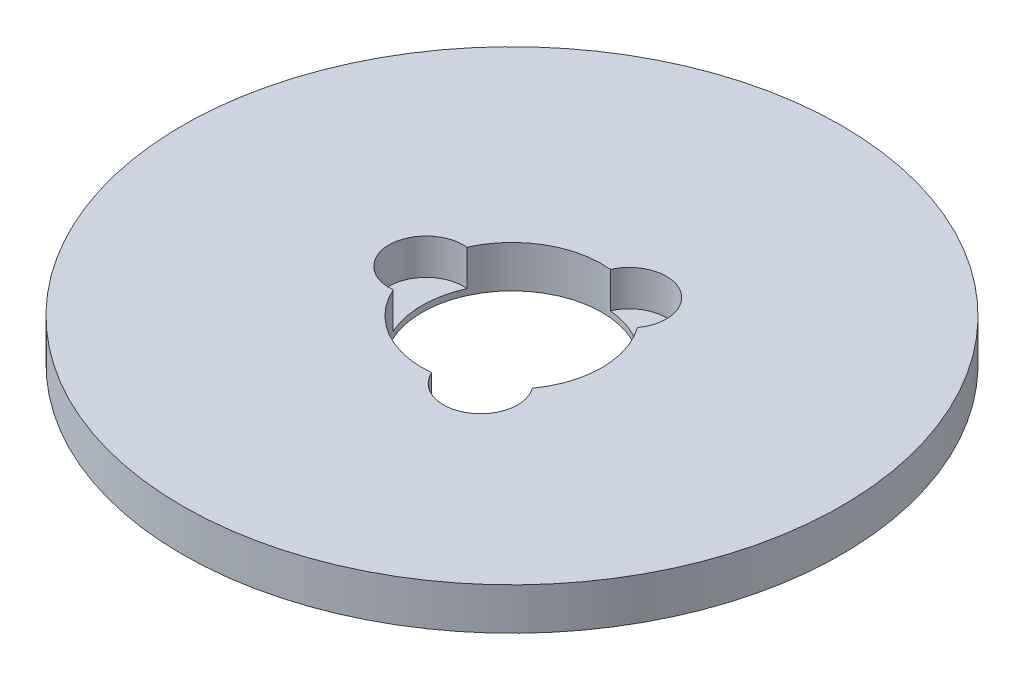
ISO-10303-21;
HEADER;
FILE_DESCRIPTION(('STEP AP214'),'2;1');
FILE_NAME('part.step','',(''),(''),'','','');
FILE_SCHEMA(('AUTOMOTIVE_DESIGN { 1 0 10303 214 1 1 1 1 }'));
ENDSEC;
DATA;
#1=APPLICATION_CONTEXT('core data for automotive mechanical design processes');
#2=APPLICATION_PROTOCOL_DEFINITION('international standard','automotive_design',2000,#1);
#3=PRODUCT_CONTEXT('',#1,'mechanical');
#4=PRODUCT('Part','Part','',(#3));
#5=PRODUCT_RELATED_PRODUCT_CATEGORY('part','',(#4));
#6=PRODUCT_DEFINITION_FORMATION('','',#4);
#7=PRODUCT_DEFINITION_CONTEXT('part definition',#1,'design');
#8=PRODUCT_DEFINITION('design','',#6,#7);
#9=PRODUCT_DEFINITION_SHAPE('','',#8);
#10=(LENGTH_UNIT() NAMED_UNIT(*) SI_UNIT(.MILLI.,.METRE.));
#11=(NAMED_UNIT(*) PLANE_ANGLE_UNIT() SI_UNIT($,.RADIAN.));
#12=(NAMED_UNIT(*) SI_UNIT($,.STERADIAN.) SOLID_ANGLE_UNIT());
#13=UNCERTAINTY_MEASURE_WITH_UNIT(LENGTH_MEASURE(1.E-05),#10,'distance_accuracy_value','');
#14=(GEOMETRIC_REPRESENTATION_CONTEXT(3) GLOBAL_UNCERTAINTY_ASSIGNED_CONTEXT((#13)) GLOBAL_UNIT_ASSIGNED_CONTEXT((#10,
#11,#12)) REPRESENTATION_CONTEXT('',''));
#15=CARTESIAN_POINT('',(0.,0.,0.));
#16=DIRECTION('',(0.,0.,1.));
#17=DIRECTION('',(1.,0.,0.));
#18=AXIS2_PLACEMENT_3D('',#15,#16,#17);
#19=CARTESIAN_POINT('',(0.,7.,0.));
#20=DIRECTION('',(0.,-1.,0.));
#21=DIRECTION('',(0.,0.,-1.));
#22=AXIS2_PLACEMENT_3D('',#19,#20,#21);
#23=CYLINDRICAL_SURFACE('',#22,55.);
#24=CARTESIAN_POINT('',(0.,7.,0.));
#25=DIRECTION('',(0.,1.,0.));
#26=DIRECTION('',(0.,0.,1.));
#27=AXIS2_PLACEMENT_3D('',#24,#25,#26);
#28=CIRCLE('',#27,55.);
#29=CARTESIAN_POINT('',(0.,7.,55.));
#30=VERTEX_POINT('',#29);
#31=EDGE_CURVE('E126',#30,#30,#28,.T.);
#32=ORIENTED_EDGE('',*,*,#31,.F.);
#33=EDGE_LOOP('',(#32));
#34=FACE_BOUND('',#33,.T.);
#35=CARTESIAN_POINT('',(0.,0.,0.));
#36=DIRECTION('',(0.,1.,0.));
#37=DIRECTION('',(0.,0.,1.));
#38=AXIS2_PLACEMENT_3D('',#35,#36,#37);
#39=CIRCLE('',#38,55.);
#40=CARTESIAN_POINT('',(0.,0.,55.));
#41=VERTEX_POINT('',#40);
#42=EDGE_CURVE('E124',#41,#41,#39,.T.);
#43=ORIENTED_EDGE('',*,*,#42,.T.);
#44=EDGE_LOOP('',(#43));
#45=FACE_BOUND('',#44,.T.);
#46=ADVANCED_FACE('F39',(#34,#45),#23,.T.);
#47=CARTESIAN_POINT('',(0.,7.,0.));
#48=DIRECTION('',(0.,1.,0.));
#49=DIRECTION('',(0.,0.,1.));
#50=AXIS2_PLACEMENT_3D('',#47,#48,#49);
#51=PLANE('',#50);
#52=CARTESIAN_POINT('',(7.16588052473661,7.,12.411669149812));
#53=DIRECTION('',(0.,1.,0.));
#54=DIRECTION('',(0.866025403784436,0.,-0.500000000000004));
#55=AXIS2_PLACEMENT_3D('',#52,#53,#54);
#56=CIRCLE('',#55,6.18322846456152);
#57=CARTESIAN_POINT('',(1.51571185711763,7.,14.9232241009171));
#58=VERTEX_POINT('',#57);
#59=CARTESIAN_POINT('',(12.1660352492037,7.,8.77425702353959));
#60=VERTEX_POINT('',#59);
#61=EDGE_CURVE('E147',#58,#60,#56,.T.);
#62=ORIENTED_EDGE('',*,*,#61,.F.);
#63=CARTESIAN_POINT('',(0.,7.,0.));
#64=DIRECTION('',(0.,1.,0.));
#65=DIRECTION('',(0.,0.,1.));
#66=AXIS2_PLACEMENT_3D('',#63,#64,#65);
#67=CIRCLE('',#66,15.);
#68=CARTESIAN_POINT('',(-13.6817471063212,7.,6.14896707737746));
#69=VERTEX_POINT('',#68);
#70=EDGE_CURVE('E118',#69,#58,#67,.T.);
#71=ORIENTED_EDGE('',*,*,#70,.F.);
#72=CARTESIAN_POINT('',(-14.3317610494731,7.,0.));
#73=DIRECTION('',(0.,1.,0.));
#74=DIRECTION('',(0.,0.,1.));
#75=AXIS2_PLACEMENT_3D('',#72,#73,#74);
#76=CIRCLE('',#75,6.18322846456152);
#77=CARTESIAN_POINT('',(-13.6817471063212,7.,-6.14896707737746));
#78=VERTEX_POINT('',#77);
#79=EDGE_CURVE('E113',#78,#69,#76,.T.);
#80=ORIENTED_EDGE('',*,*,#79,.F.);
#81=CARTESIAN_POINT('',(1.51571185711742,7.,-14.9232241009171));
#82=VERTEX_POINT('',#81);
#83=EDGE_CURVE('E106',#82,#78,#67,.T.);
#84=ORIENTED_EDGE('',*,*,#83,.F.);
#85=CARTESIAN_POINT('',(7.16588052473644,7.,-12.4116691498121));
#86=DIRECTION('',(0.,1.,0.));
#87=DIRECTION('',(-0.866025403784443,0.,-0.499999999999992));
#88=AXIS2_PLACEMENT_3D('',#85,#86,#87);
#89=CIRCLE('',#88,6.18322846456152);
#90=CARTESIAN_POINT('',(12.1660352492035,7.,-8.77425702353976));
#91=VERTEX_POINT('',#90);
#92=EDGE_CURVE('E90',#91,#82,#89,.T.);
#93=ORIENTED_EDGE('',*,*,#92,.F.);
#94=EDGE_CURVE('E116',#60,#91,#67,.T.);
#95=ORIENTED_EDGE('',*,*,#94,.F.);
#96=EDGE_LOOP('',(#62,#71,#80,#84,#93,#95));
#97=FACE_BOUND('',#96,.T.);
#98=ORIENTED_EDGE('',*,*,#31,.T.);
#99=EDGE_LOOP('',(#98));
#100=FACE_BOUND('',#99,.T.);
#101=ADVANCED_FACE('F115',(#97,#100),#51,.T.);
#102=CARTESIAN_POINT('',(0.,0.,0.));
#103=DIRECTION('',(0.,1.,0.));
#104=DIRECTION('',(0.,0.,1.));
#105=AXIS2_PLACEMENT_3D('',#102,#103,#104);
#106=PLANE('',#105);
#107=CARTESIAN_POINT('',(0.,0.,0.));
#108=DIRECTION('',(0.,1.,0.));
#109=DIRECTION('',(0.,0.,1.));
#110=AXIS2_PLACEMENT_3D('',#107,#108,#109);
#111=CIRCLE('',#110,15.);
#112=CARTESIAN_POINT('',(0.,0.,15.));
#113=VERTEX_POINT('',#112);
#114=EDGE_CURVE('E120',#113,#113,#111,.T.);
#115=ORIENTED_EDGE('',*,*,#114,.T.);
#116=EDGE_LOOP('',(#115));
#117=FACE_BOUND('',#116,.T.);
#118=ORIENTED_EDGE('',*,*,#42,.F.);
#119=EDGE_LOOP('',(#118));
#120=FACE_BOUND('',#119,.T.);
#121=ADVANCED_FACE('F164',(#117,#120),#106,.F.);
#122=CARTESIAN_POINT('',(0.,7.,0.));
#123=DIRECTION('',(0.,-1.,0.));
#124=DIRECTION('',(0.,0.,-1.));
#125=AXIS2_PLACEMENT_3D('',#122,#123,#124);
#126=CYLINDRICAL_SURFACE('',#125,15.);
#127=DIRECTION('',(0.,1.,0.));
#128=VECTOR('',#127,1.);
#129=CARTESIAN_POINT('',(1.51571185711763,4.0082175307494,14.9232241009171));
#130=LINE('',#129,#128);
#131=CARTESIAN_POINT('',(1.51571185711763,1.01643506149879,14.9232241009171));
#132=VERTEX_POINT('',#131);
#133=EDGE_CURVE('E11',#132,#58,#130,.T.);
#134=ORIENTED_EDGE('',*,*,#133,.F.);
#135=CARTESIAN_POINT('',(0.,1.01643506149879,0.));
#136=DIRECTION('',(0.,1.,0.));
#137=DIRECTION('',(0.,0.,1.));
#138=AXIS2_PLACEMENT_3D('',#135,#136,#137);
#139=CIRCLE('',#138,15.);
#140=CARTESIAN_POINT('',(12.1660352492037,1.01643506149879,8.77425702353959));
#141=VERTEX_POINT('',#140);
#142=EDGE_CURVE('E144',#132,#141,#139,.T.);
#143=ORIENTED_EDGE('',*,*,#142,.T.);
#144=DIRECTION('',(0.,1.,0.));
#145=VECTOR('',#144,1.);
#146=CARTESIAN_POINT('',(12.1660352492037,4.0082175307494,8.77425702353959));
#147=LINE('',#146,#145);
#148=EDGE_CURVE('E46',#60,#141,#147,.F.);
#149=ORIENTED_EDGE('',*,*,#148,.F.);
#150=ORIENTED_EDGE('',*,*,#94,.T.);
#151=DIRECTION('',(0.,1.,0.));
#152=VECTOR('',#151,1.);
#153=CARTESIAN_POINT('',(12.1660352492035,4.0082175307494,-8.77425702353976));
#154=LINE('',#153,#152);
#155=CARTESIAN_POINT('',(12.1660352492035,1.01643506149879,-8.77425702353976));
#156=VERTEX_POINT('',#155);
#157=EDGE_CURVE('E92',#156,#91,#154,.T.);
#158=ORIENTED_EDGE('',*,*,#157,.F.);
#159=CARTESIAN_POINT('',(0.,1.01643506149879,0.));
#160=DIRECTION('',(0.,1.,0.));
#161=DIRECTION('',(0.,0.,1.));
#162=AXIS2_PLACEMENT_3D('',#159,#160,#161);
#163=CIRCLE('',#162,15.);
#164=CARTESIAN_POINT('',(1.51571185711742,1.01643506149879,-14.9232241009171));
#165=VERTEX_POINT('',#164);
#166=EDGE_CURVE('E107',#156,#165,#163,.T.);
#167=ORIENTED_EDGE('',*,*,#166,.T.);
#168=DIRECTION('',(0.,1.,0.));
#169=VECTOR('',#168,1.);
#170=CARTESIAN_POINT('',(1.51571185711742,4.0082175307494,-14.9232241009171));
#171=LINE('',#170,#169);
#172=EDGE_CURVE('E95',#82,#165,#171,.F.);
#173=ORIENTED_EDGE('',*,*,#172,.F.);
#174=ORIENTED_EDGE('',*,*,#83,.T.);
#175=DIRECTION('',(0.,1.,0.));
#176=VECTOR('',#175,1.);
#177=CARTESIAN_POINT('',(-13.6817471063212,4.0082175307494,-6.14896707737746));
#178=LINE('',#177,#176);
#179=CARTESIAN_POINT('',(-13.6817471063212,1.01643506149879,-6.14896707737746));
#180=VERTEX_POINT('',#179);
#181=EDGE_CURVE('E143',#180,#78,#178,.T.);
#182=ORIENTED_EDGE('',*,*,#181,.F.);
#183=CARTESIAN_POINT('',(0.,1.01643506149879,0.));
#184=DIRECTION('',(0.,1.,0.));
#185=DIRECTION('',(0.,0.,1.));
#186=AXIS2_PLACEMENT_3D('',#183,#184,#185);
#187=CIRCLE('',#186,15.);
#188=CARTESIAN_POINT('',(-13.6817471063212,1.01643506149879,6.14896707737746));
#189=VERTEX_POINT('',#188);
#190=EDGE_CURVE('E132',#180,#189,#187,.T.);
#191=ORIENTED_EDGE('',*,*,#190,.T.);
#192=DIRECTION('',(0.,1.,0.));
#193=VECTOR('',#192,1.);
#194=CARTESIAN_POINT('',(-13.6817471063212,4.0082175307494,6.14896707737746));
#195=LINE('',#194,#193);
#196=EDGE_CURVE('E137',#69,#189,#195,.F.);
#197=ORIENTED_EDGE('',*,*,#196,.F.);
#198=ORIENTED_EDGE('',*,*,#70,.T.);
#199=EDGE_LOOP('',(#134,#143,#149,#150,#158,#167,#173,#174,#182,#191,#197,#198));
#200=FACE_BOUND('',#199,.T.);
#201=ORIENTED_EDGE('',*,*,#114,.F.);
#202=EDGE_LOOP('',(#201));
#203=FACE_BOUND('',#202,.T.);
#204=ADVANCED_FACE('F103',(#200,#203),#126,.F.);
#205=CARTESIAN_POINT('',(-14.3317610494731,1.01643506149879,0.));
#206=DIRECTION('',(0.,1.,0.));
#207=DIRECTION('',(0.,0.,1.));
#208=AXIS2_PLACEMENT_3D('',#205,#206,#207);
#209=CYLINDRICAL_SURFACE('',#208,6.18322846456152);
#210=ORIENTED_EDGE('',*,*,#181,.T.);
#211=ORIENTED_EDGE('',*,*,#79,.T.);
#212=ORIENTED_EDGE('',*,*,#196,.T.);
#213=CARTESIAN_POINT('',(-14.3317610494731,1.01643506149879,0.));
#214=DIRECTION('',(0.,1.,0.));
#215=DIRECTION('',(0.,0.,1.));
#216=AXIS2_PLACEMENT_3D('',#213,#214,#215);
#217=CIRCLE('',#216,6.18322846456152);
#218=EDGE_CURVE('E121',#180,#189,#217,.T.);
#219=ORIENTED_EDGE('',*,*,#218,.F.);
#220=EDGE_LOOP('',(#210,#211,#212,#219));
#221=FACE_BOUND('',#220,.T.);
#222=ADVANCED_FACE('F174',(#221),#209,.F.);
#223=CARTESIAN_POINT('',(-14.3317610494731,1.01643506149879,0.));
#224=DIRECTION('',(0.,1.,0.));
#225=DIRECTION('',(0.,0.,1.));
#226=AXIS2_PLACEMENT_3D('',#223,#224,#225);
#227=PLANE('',#226);
#228=ORIENTED_EDGE('',*,*,#218,.T.);
#229=ORIENTED_EDGE('',*,*,#190,.F.);
#230=EDGE_LOOP('',(#228,#229));
#231=FACE_BOUND('',#230,.T.);
#232=ADVANCED_FACE('F177',(#231),#227,.T.);
#233=CARTESIAN_POINT('',(7.16588052473644,1.01643506149879,-12.4116691498121));
#234=DIRECTION('',(0.,1.,0.));
#235=DIRECTION('',(0.,0.,1.));
#236=AXIS2_PLACEMENT_3D('',#233,#234,#235);
#237=CYLINDRICAL_SURFACE('',#236,6.18322846456152);
#238=ORIENTED_EDGE('',*,*,#157,.T.);
#239=ORIENTED_EDGE('',*,*,#92,.T.);
#240=ORIENTED_EDGE('',*,*,#172,.T.);
#241=CARTESIAN_POINT('',(7.16588052473644,1.01643506149879,-12.4116691498121));
#242=DIRECTION('',(0.,1.,0.));
#243=DIRECTION('',(-0.866025403784443,0.,-0.499999999999992));
#244=AXIS2_PLACEMENT_3D('',#241,#242,#243);
#245=CIRCLE('',#244,6.18322846456152);
#246=EDGE_CURVE('E56',#156,#165,#245,.T.);
#247=ORIENTED_EDGE('',*,*,#246,.F.);
#248=EDGE_LOOP('',(#238,#239,#240,#247));
#249=FACE_BOUND('',#248,.T.);
#250=ADVANCED_FACE('F93',(#249),#237,.F.);
#251=CARTESIAN_POINT('',(7.16588052473644,1.01643506149879,-12.4116691498121));
#252=DIRECTION('',(0.,1.,0.));
#253=DIRECTION('',(-0.866025403784443,0.,-0.499999999999992));
#254=AXIS2_PLACEMENT_3D('',#251,#252,#253);
#255=PLANE('',#254);
#256=ORIENTED_EDGE('',*,*,#246,.T.);
#257=ORIENTED_EDGE('',*,*,#166,.F.);
#258=EDGE_LOOP('',(#256,#257));
#259=FACE_BOUND('',#258,.T.);
#260=ADVANCED_FACE('F160',(#259),#255,.T.);
#261=CARTESIAN_POINT('',(7.16588052473661,1.01643506149879,12.411669149812));
#262=DIRECTION('',(0.,1.,0.));
#263=DIRECTION('',(0.,0.,1.));
#264=AXIS2_PLACEMENT_3D('',#261,#262,#263);
#265=CYLINDRICAL_SURFACE('',#264,6.18322846456152);
#266=ORIENTED_EDGE('',*,*,#133,.T.);
#267=ORIENTED_EDGE('',*,*,#61,.T.);
#268=ORIENTED_EDGE('',*,*,#148,.T.);
#269=CARTESIAN_POINT('',(7.16588052473661,1.01643506149879,12.411669149812));
#270=DIRECTION('',(0.,1.,0.));
#271=DIRECTION('',(0.866025403784436,0.,-0.500000000000004));
#272=AXIS2_PLACEMENT_3D('',#269,#270,#271);
#273=CIRCLE('',#272,6.18322846456152);
#274=EDGE_CURVE('E55',#132,#141,#273,.T.);
#275=ORIENTED_EDGE('',*,*,#274,.F.);
#276=EDGE_LOOP('',(#266,#267,#268,#275));
#277=FACE_BOUND('',#276,.T.);
#278=ADVANCED_FACE('F149',(#277),#265,.F.);
#279=CARTESIAN_POINT('',(7.16588052473661,1.01643506149879,12.411669149812));
#280=DIRECTION('',(0.,1.,0.));
#281=DIRECTION('',(0.866025403784436,0.,-0.500000000000004));
#282=AXIS2_PLACEMENT_3D('',#279,#280,#281);
#283=PLANE('',#282);
#284=ORIENTED_EDGE('',*,*,#274,.T.);
#285=ORIENTED_EDGE('',*,*,#142,.F.);
#286=EDGE_LOOP('',(#284,#285));
#287=FACE_BOUND('',#286,.T.);
#288=ADVANCED_FACE('F151',(#287),#283,.T.);
#289=CLOSED_SHELL('',(#46,#101,#121,#204,#222,#232,#250,#260,#278,#288));
#290=MANIFOLD_SOLID_BREP('B2',#289);
#291=ADVANCED_BREP_SHAPE_REPRESENTATION('',(#18,#290),#14);
#292=SHAPE_DEFINITION_REPRESENTATION(#9,#291);
ENDSEC;
END-ISO-10303-21;
